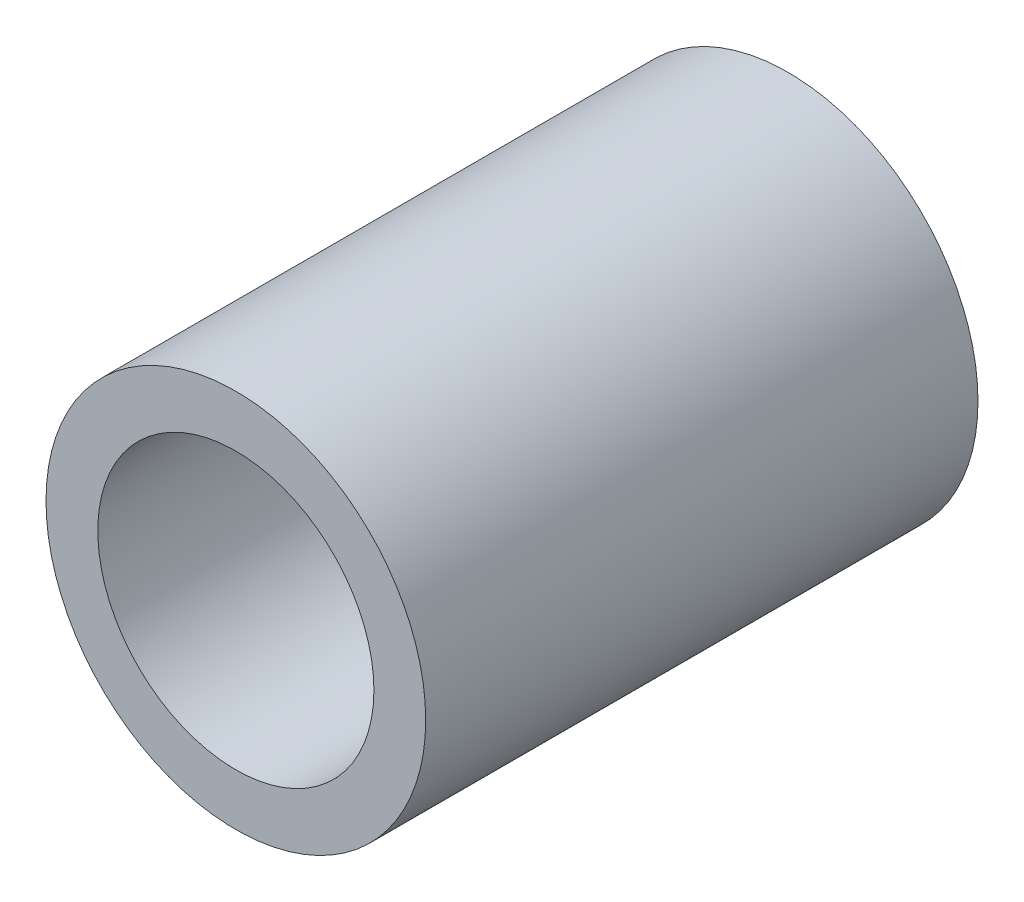
ISO-10303-21;
HEADER;
FILE_DESCRIPTION(('STEP AP214'),'2;1');
FILE_NAME('part.step','',(''),(''),'','','');
FILE_SCHEMA(('AUTOMOTIVE_DESIGN { 1 0 10303 214 1 1 1 1 }'));
ENDSEC;
DATA;
#1=APPLICATION_CONTEXT('core data for automotive mechanical design processes');
#2=APPLICATION_PROTOCOL_DEFINITION('international standard','automotive_design',2000,#1);
#3=PRODUCT_CONTEXT('',#1,'mechanical');
#4=PRODUCT('Part','Part','',(#3));
#5=PRODUCT_RELATED_PRODUCT_CATEGORY('part','',(#4));
#6=PRODUCT_DEFINITION_FORMATION('','',#4);
#7=PRODUCT_DEFINITION_CONTEXT('part definition',#1,'design');
#8=PRODUCT_DEFINITION('design','',#6,#7);
#9=PRODUCT_DEFINITION_SHAPE('','',#8);
#10=(LENGTH_UNIT() NAMED_UNIT(*) SI_UNIT(.MILLI.,.METRE.));
#11=(NAMED_UNIT(*) PLANE_ANGLE_UNIT() SI_UNIT($,.RADIAN.));
#12=(NAMED_UNIT(*) SI_UNIT($,.STERADIAN.) SOLID_ANGLE_UNIT());
#13=UNCERTAINTY_MEASURE_WITH_UNIT(LENGTH_MEASURE(1.E-05),#10,'distance_accuracy_value','');
#14=(GEOMETRIC_REPRESENTATION_CONTEXT(3) GLOBAL_UNCERTAINTY_ASSIGNED_CONTEXT((#13)) GLOBAL_UNIT_ASSIGNED_CONTEXT((#10,
#11,#12)) REPRESENTATION_CONTEXT('',''));
#15=CARTESIAN_POINT('',(0.,0.,0.));
#16=DIRECTION('',(0.,0.,1.));
#17=DIRECTION('',(1.,0.,0.));
#18=AXIS2_PLACEMENT_3D('',#15,#16,#17);
#19=CARTESIAN_POINT('',(0.,0.,8.));
#20=DIRECTION('',(0.,0.,1.));
#21=DIRECTION('',(1.,0.,0.));
#22=AXIS2_PLACEMENT_3D('',#19,#20,#21);
#23=PLANE('',#22);
#24=CARTESIAN_POINT('',(0.,0.,8.));
#25=DIRECTION('',(0.,0.,1.));
#26=DIRECTION('',(1.,0.,0.));
#27=AXIS2_PLACEMENT_3D('',#24,#25,#26);
#28=CIRCLE('',#27,2.75);
#29=CARTESIAN_POINT('',(2.75,0.,8.));
#30=VERTEX_POINT('',#29);
#31=EDGE_CURVE('E10',#30,#30,#28,.T.);
#32=ORIENTED_EDGE('',*,*,#31,.T.);
#33=EDGE_LOOP('',(#32));
#34=FACE_BOUND('',#33,.T.);
#35=CARTESIAN_POINT('',(0.,0.,8.));
#36=DIRECTION('',(0.,0.,1.));
#37=DIRECTION('',(1.,0.,0.));
#38=AXIS2_PLACEMENT_3D('',#35,#36,#37);
#39=CIRCLE('',#38,2.);
#40=CARTESIAN_POINT('',(2.,0.,8.));
#41=VERTEX_POINT('',#40);
#42=EDGE_CURVE('E50',#41,#41,#39,.T.);
#43=ORIENTED_EDGE('',*,*,#42,.F.);
#44=EDGE_LOOP('',(#43));
#45=FACE_BOUND('',#44,.T.);
#46=ADVANCED_FACE('F37',(#34,#45),#23,.T.);
#47=CARTESIAN_POINT('',(0.,0.,0.));
#48=DIRECTION('',(0.,0.,1.));
#49=DIRECTION('',(1.,0.,0.));
#50=AXIS2_PLACEMENT_3D('',#47,#48,#49);
#51=PLANE('',#50);
#52=CARTESIAN_POINT('',(0.,0.,0.));
#53=DIRECTION('',(0.,0.,1.));
#54=DIRECTION('',(1.,0.,0.));
#55=AXIS2_PLACEMENT_3D('',#52,#53,#54);
#56=CIRCLE('',#55,2.75);
#57=CARTESIAN_POINT('',(2.75,0.,0.));
#58=VERTEX_POINT('',#57);
#59=EDGE_CURVE('E41',#58,#58,#56,.T.);
#60=ORIENTED_EDGE('',*,*,#59,.F.);
#61=EDGE_LOOP('',(#60));
#62=FACE_BOUND('',#61,.T.);
#63=CARTESIAN_POINT('',(0.,0.,0.));
#64=DIRECTION('',(0.,0.,1.));
#65=DIRECTION('',(1.,0.,0.));
#66=AXIS2_PLACEMENT_3D('',#63,#64,#65);
#67=CIRCLE('',#66,2.);
#68=CARTESIAN_POINT('',(2.,0.,0.));
#69=VERTEX_POINT('',#68);
#70=EDGE_CURVE('E52',#69,#69,#67,.T.);
#71=ORIENTED_EDGE('',*,*,#70,.T.);
#72=EDGE_LOOP('',(#71));
#73=FACE_BOUND('',#72,.T.);
#74=ADVANCED_FACE('F64',(#62,#73),#51,.F.);
#75=CARTESIAN_POINT('',(0.,0.,8.));
#76=DIRECTION('',(0.,0.,-1.));
#77=DIRECTION('',(-1.,0.,0.));
#78=AXIS2_PLACEMENT_3D('',#75,#76,#77);
#79=CYLINDRICAL_SURFACE('',#78,2.75);
#80=ORIENTED_EDGE('',*,*,#31,.F.);
#81=EDGE_LOOP('',(#80));
#82=FACE_BOUND('',#81,.T.);
#83=ORIENTED_EDGE('',*,*,#59,.T.);
#84=EDGE_LOOP('',(#83));
#85=FACE_BOUND('',#84,.T.);
#86=ADVANCED_FACE('F39',(#82,#85),#79,.T.);
#87=CARTESIAN_POINT('',(0.,0.,8.));
#88=DIRECTION('',(0.,0.,-1.));
#89=DIRECTION('',(-1.,0.,0.));
#90=AXIS2_PLACEMENT_3D('',#87,#88,#89);
#91=CYLINDRICAL_SURFACE('',#90,2.);
#92=ORIENTED_EDGE('',*,*,#42,.T.);
#93=EDGE_LOOP('',(#92));
#94=FACE_BOUND('',#93,.T.);
#95=ORIENTED_EDGE('',*,*,#70,.F.);
#96=EDGE_LOOP('',(#95));
#97=FACE_BOUND('',#96,.T.);
#98=ADVANCED_FACE('F60',(#94,#97),#91,.F.);
#99=CLOSED_SHELL('',(#46,#74,#86,#98));
#100=MANIFOLD_SOLID_BREP('B2',#99);
#101=ADVANCED_BREP_SHAPE_REPRESENTATION('',(#18,#100),#14);
#102=SHAPE_DEFINITION_REPRESENTATION(#9,#101);
ENDSEC;
END-ISO-10303-21;
